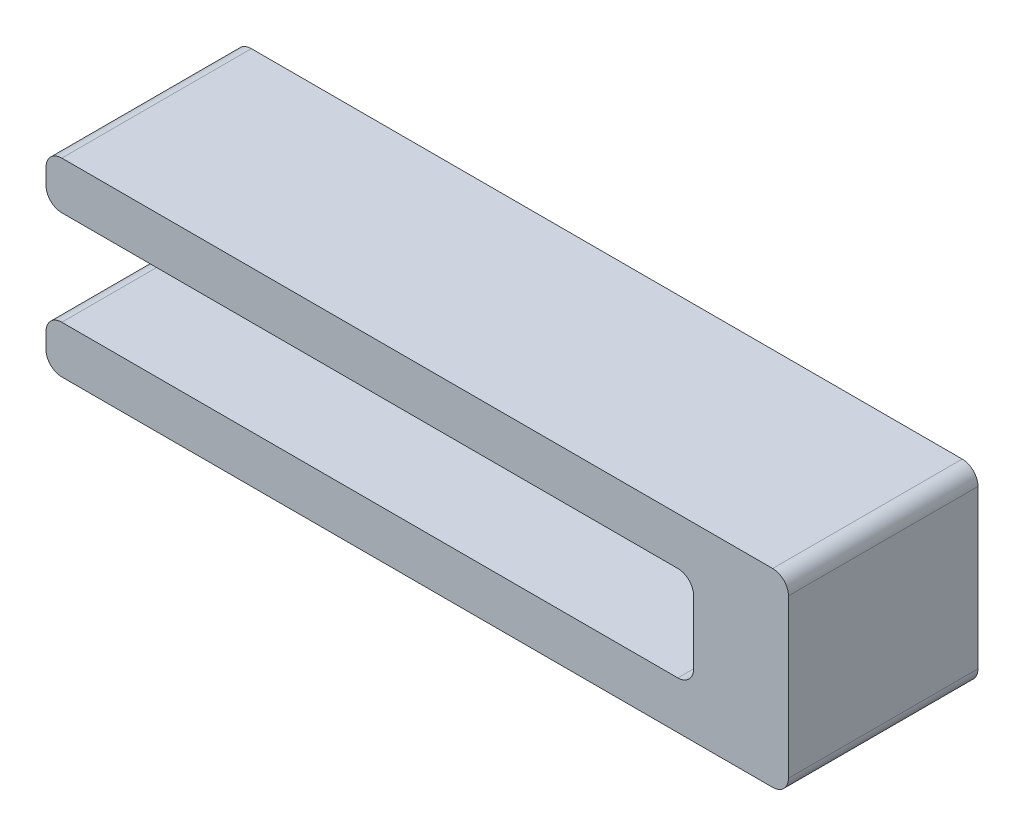
ISO-10303-21;
HEADER;
FILE_DESCRIPTION(('STEP AP214'),'2;1');
FILE_NAME('part.step','',(''),(''),'','','');
FILE_SCHEMA(('AUTOMOTIVE_DESIGN { 1 0 10303 214 1 1 1 1 }'));
ENDSEC;
DATA;
#1=APPLICATION_CONTEXT('core data for automotive mechanical design processes');
#2=APPLICATION_PROTOCOL_DEFINITION('international standard','automotive_design',2000,#1);
#3=PRODUCT_CONTEXT('',#1,'mechanical');
#4=PRODUCT('Part','Part','',(#3));
#5=PRODUCT_RELATED_PRODUCT_CATEGORY('part','',(#4));
#6=PRODUCT_DEFINITION_FORMATION('','',#4);
#7=PRODUCT_DEFINITION_CONTEXT('part definition',#1,'design');
#8=PRODUCT_DEFINITION('design','',#6,#7);
#9=PRODUCT_DEFINITION_SHAPE('','',#8);
#10=(LENGTH_UNIT() NAMED_UNIT(*) SI_UNIT(.MILLI.,.METRE.));
#11=(NAMED_UNIT(*) PLANE_ANGLE_UNIT() SI_UNIT($,.RADIAN.));
#12=(NAMED_UNIT(*) SI_UNIT($,.STERADIAN.) SOLID_ANGLE_UNIT());
#13=UNCERTAINTY_MEASURE_WITH_UNIT(LENGTH_MEASURE(1.E-05),#10,'distance_accuracy_value','');
#14=(GEOMETRIC_REPRESENTATION_CONTEXT(3) GLOBAL_UNCERTAINTY_ASSIGNED_CONTEXT((#13)) GLOBAL_UNIT_ASSIGNED_CONTEXT((#10,
#11,#12)) REPRESENTATION_CONTEXT('',''));
#15=CARTESIAN_POINT('',(0.,0.,0.));
#16=DIRECTION('',(0.,0.,1.));
#17=DIRECTION('',(1.,0.,0.));
#18=AXIS2_PLACEMENT_3D('',#15,#16,#17);
#19=CARTESIAN_POINT('',(0.,4.5,6.));
#20=DIRECTION('',(0.,1.,0.));
#21=DIRECTION('',(0.,0.,1.));
#22=AXIS2_PLACEMENT_3D('',#19,#20,#21);
#23=PLANE('',#22);
#24=DIRECTION('',(1.,0.,0.));
#25=VECTOR('',#24,1.);
#26=CARTESIAN_POINT('',(0.,4.5,0.));
#27=LINE('',#26,#25);
#28=CARTESIAN_POINT('',(0.5,4.5,0.));
#29=VERTEX_POINT('',#28);
#30=CARTESIAN_POINT('',(20.,4.5,0.));
#31=VERTEX_POINT('',#30);
#32=EDGE_CURVE('E190',#29,#31,#27,.T.);
#33=ORIENTED_EDGE('',*,*,#32,.T.);
#34=DIRECTION('',(0.,0.,-1.));
#35=VECTOR('',#34,1.);
#36=CARTESIAN_POINT('',(20.,4.5,6.));
#37=LINE('',#36,#35);
#38=CARTESIAN_POINT('',(20.,4.5,6.));
#39=VERTEX_POINT('',#38);
#40=EDGE_CURVE('E165',#31,#39,#37,.F.);
#41=ORIENTED_EDGE('',*,*,#40,.T.);
#42=DIRECTION('',(1.,0.,0.));
#43=VECTOR('',#42,1.);
#44=CARTESIAN_POINT('',(0.,4.5,6.));
#45=LINE('',#44,#43);
#46=CARTESIAN_POINT('',(0.5,4.5,6.));
#47=VERTEX_POINT('',#46);
#48=EDGE_CURVE('E322',#47,#39,#45,.T.);
#49=ORIENTED_EDGE('',*,*,#48,.F.);
#50=DIRECTION('',(0.,0.,-1.));
#51=VECTOR('',#50,1.);
#52=CARTESIAN_POINT('',(0.5,4.5,0.));
#53=LINE('',#52,#51);
#54=EDGE_CURVE('E182',#47,#29,#53,.T.);
#55=ORIENTED_EDGE('',*,*,#54,.T.);
#56=EDGE_LOOP('',(#33,#41,#49,#55));
#57=FACE_BOUND('',#56,.T.);
#58=ADVANCED_FACE('F45',(#57),#23,.F.);
#59=CARTESIAN_POINT('',(20.5,0.,6.));
#60=DIRECTION('',(1.,0.,0.));
#61=DIRECTION('',(0.,0.,-1.));
#62=AXIS2_PLACEMENT_3D('',#59,#60,#61);
#63=PLANE('',#62);
#64=DIRECTION('',(0.,-1.,0.));
#65=VECTOR('',#64,1.);
#66=CARTESIAN_POINT('',(20.5,0.,6.));
#67=LINE('',#66,#65);
#68=CARTESIAN_POINT('',(20.5,4.,6.));
#69=VERTEX_POINT('',#68);
#70=CARTESIAN_POINT('',(20.5,2.,6.));
#71=VERTEX_POINT('',#70);
#72=EDGE_CURVE('E180',#69,#71,#67,.T.);
#73=ORIENTED_EDGE('',*,*,#72,.F.);
#74=DIRECTION('',(0.,0.,-1.));
#75=VECTOR('',#74,1.);
#76=CARTESIAN_POINT('',(20.5,4.,0.));
#77=LINE('',#76,#75);
#78=CARTESIAN_POINT('',(20.5,4.,0.));
#79=VERTEX_POINT('',#78);
#80=EDGE_CURVE('E164',#69,#79,#77,.T.);
#81=ORIENTED_EDGE('',*,*,#80,.T.);
#82=DIRECTION('',(0.,-1.,0.));
#83=VECTOR('',#82,1.);
#84=CARTESIAN_POINT('',(20.5,0.,0.));
#85=LINE('',#84,#83);
#86=CARTESIAN_POINT('',(20.5,2.,0.));
#87=VERTEX_POINT('',#86);
#88=EDGE_CURVE('E177',#79,#87,#85,.T.);
#89=ORIENTED_EDGE('',*,*,#88,.T.);
#90=DIRECTION('',(0.,0.,-1.));
#91=VECTOR('',#90,1.);
#92=CARTESIAN_POINT('',(20.5,2.,6.));
#93=LINE('',#92,#91);
#94=EDGE_CURVE('E183',#87,#71,#93,.F.);
#95=ORIENTED_EDGE('',*,*,#94,.T.);
#96=EDGE_LOOP('',(#73,#81,#89,#95));
#97=FACE_BOUND('',#96,.T.);
#98=ADVANCED_FACE('F176',(#97),#63,.F.);
#99=CARTESIAN_POINT('',(0.,1.5,6.));
#100=DIRECTION('',(0.,1.,0.));
#101=DIRECTION('',(0.,0.,1.));
#102=AXIS2_PLACEMENT_3D('',#99,#100,#101);
#103=PLANE('',#102);
#104=DIRECTION('',(1.,0.,0.));
#105=VECTOR('',#104,1.);
#106=CARTESIAN_POINT('',(0.,1.5,6.));
#107=LINE('',#106,#105);
#108=CARTESIAN_POINT('',(0.5,1.5,6.));
#109=VERTEX_POINT('',#108);
#110=CARTESIAN_POINT('',(20.,1.5,6.));
#111=VERTEX_POINT('',#110);
#112=EDGE_CURVE('E317',#109,#111,#107,.T.);
#113=ORIENTED_EDGE('',*,*,#112,.T.);
#114=DIRECTION('',(0.,0.,-1.));
#115=VECTOR('',#114,1.);
#116=CARTESIAN_POINT('',(20.,1.5,6.));
#117=LINE('',#116,#115);
#118=CARTESIAN_POINT('',(20.,1.5,0.));
#119=VERTEX_POINT('',#118);
#120=EDGE_CURVE('E274',#111,#119,#117,.T.);
#121=ORIENTED_EDGE('',*,*,#120,.T.);
#122=DIRECTION('',(1.,0.,0.));
#123=VECTOR('',#122,1.);
#124=CARTESIAN_POINT('',(0.,1.5,0.));
#125=LINE('',#124,#123);
#126=CARTESIAN_POINT('',(0.5,1.5,0.));
#127=VERTEX_POINT('',#126);
#128=EDGE_CURVE('E189',#127,#119,#125,.T.);
#129=ORIENTED_EDGE('',*,*,#128,.F.);
#130=DIRECTION('',(0.,0.,-1.));
#131=VECTOR('',#130,1.);
#132=CARTESIAN_POINT('',(0.5,1.5,6.));
#133=LINE('',#132,#131);
#134=EDGE_CURVE('E271',#127,#109,#133,.F.);
#135=ORIENTED_EDGE('',*,*,#134,.T.);
#136=EDGE_LOOP('',(#113,#121,#129,#135));
#137=FACE_BOUND('',#136,.T.);
#138=ADVANCED_FACE('F343',(#137),#103,.T.);
#139=CARTESIAN_POINT('',(0.,0.,6.));
#140=DIRECTION('',(-1.,0.,0.));
#141=DIRECTION('',(0.,0.,1.));
#142=AXIS2_PLACEMENT_3D('',#139,#140,#141);
#143=PLANE('',#142);
#144=DIRECTION('',(0.,1.,0.));
#145=VECTOR('',#144,1.);
#146=CARTESIAN_POINT('',(0.,0.,0.));
#147=LINE('',#146,#145);
#148=CARTESIAN_POINT('',(0.,0.5,0.));
#149=VERTEX_POINT('',#148);
#150=CARTESIAN_POINT('',(0.,1.,0.));
#151=VERTEX_POINT('',#150);
#152=EDGE_CURVE('E194',#149,#151,#147,.T.);
#153=ORIENTED_EDGE('',*,*,#152,.F.);
#154=DIRECTION('',(0.,0.,-1.));
#155=VECTOR('',#154,1.);
#156=CARTESIAN_POINT('',(0.,0.5,6.));
#157=LINE('',#156,#155);
#158=CARTESIAN_POINT('',(0.,0.5,6.));
#159=VERTEX_POINT('',#158);
#160=EDGE_CURVE('E289',#149,#159,#157,.F.);
#161=ORIENTED_EDGE('',*,*,#160,.T.);
#162=DIRECTION('',(0.,1.,0.));
#163=VECTOR('',#162,1.);
#164=CARTESIAN_POINT('',(0.,0.,6.));
#165=LINE('',#164,#163);
#166=CARTESIAN_POINT('',(0.,1.,6.));
#167=VERTEX_POINT('',#166);
#168=EDGE_CURVE('E304',#159,#167,#165,.T.);
#169=ORIENTED_EDGE('',*,*,#168,.T.);
#170=DIRECTION('',(0.,0.,-1.));
#171=VECTOR('',#170,1.);
#172=CARTESIAN_POINT('',(0.,1.,6.));
#173=LINE('',#172,#171);
#174=EDGE_CURVE('E285',#167,#151,#173,.T.);
#175=ORIENTED_EDGE('',*,*,#174,.T.);
#176=EDGE_LOOP('',(#153,#161,#169,#175));
#177=FACE_BOUND('',#176,.T.);
#178=ADVANCED_FACE('F397',(#177),#143,.T.);
#179=CARTESIAN_POINT('',(0.,0.,6.));
#180=DIRECTION('',(0.,1.,0.));
#181=DIRECTION('',(0.,0.,1.));
#182=AXIS2_PLACEMENT_3D('',#179,#180,#181);
#183=PLANE('',#182);
#184=DIRECTION('',(1.,0.,0.));
#185=VECTOR('',#184,1.);
#186=CARTESIAN_POINT('',(0.,0.,0.));
#187=LINE('',#186,#185);
#188=CARTESIAN_POINT('',(0.5,0.,0.));
#189=VERTEX_POINT('',#188);
#190=CARTESIAN_POINT('',(23.,0.,0.));
#191=VERTEX_POINT('',#190);
#192=EDGE_CURVE('E202',#189,#191,#187,.T.);
#193=ORIENTED_EDGE('',*,*,#192,.T.);
#194=DIRECTION('',(0.,0.,-1.));
#195=VECTOR('',#194,1.);
#196=CARTESIAN_POINT('',(23.,0.,6.));
#197=LINE('',#196,#195);
#198=CARTESIAN_POINT('',(23.,0.,6.));
#199=VERTEX_POINT('',#198);
#200=EDGE_CURVE('E282',#191,#199,#197,.F.);
#201=ORIENTED_EDGE('',*,*,#200,.T.);
#202=DIRECTION('',(1.,0.,0.));
#203=VECTOR('',#202,1.);
#204=CARTESIAN_POINT('',(0.,0.,6.));
#205=LINE('',#204,#203);
#206=CARTESIAN_POINT('',(0.5,0.,6.));
#207=VERTEX_POINT('',#206);
#208=EDGE_CURVE('E310',#207,#199,#205,.T.);
#209=ORIENTED_EDGE('',*,*,#208,.F.);
#210=DIRECTION('',(0.,0.,-1.));
#211=VECTOR('',#210,1.);
#212=CARTESIAN_POINT('',(0.5,0.,0.));
#213=LINE('',#212,#211);
#214=EDGE_CURVE('E278',#207,#189,#213,.T.);
#215=ORIENTED_EDGE('',*,*,#214,.T.);
#216=EDGE_LOOP('',(#193,#201,#209,#215));
#217=FACE_BOUND('',#216,.T.);
#218=ADVANCED_FACE('F390',(#217),#183,.F.);
#219=CARTESIAN_POINT('',(23.5,0.,6.));
#220=DIRECTION('',(-1.,0.,0.));
#221=DIRECTION('',(0.,0.,1.));
#222=AXIS2_PLACEMENT_3D('',#219,#220,#221);
#223=PLANE('',#222);
#224=DIRECTION('',(0.,1.,0.));
#225=VECTOR('',#224,1.);
#226=CARTESIAN_POINT('',(23.5,0.,0.));
#227=LINE('',#226,#225);
#228=CARTESIAN_POINT('',(23.5,0.5,0.));
#229=VERTEX_POINT('',#228);
#230=CARTESIAN_POINT('',(23.5,5.5,0.));
#231=VERTEX_POINT('',#230);
#232=EDGE_CURVE('E207',#229,#231,#227,.T.);
#233=ORIENTED_EDGE('',*,*,#232,.T.);
#234=DIRECTION('',(0.,0.,-1.));
#235=VECTOR('',#234,1.);
#236=CARTESIAN_POINT('',(23.5,5.5,6.));
#237=LINE('',#236,#235);
#238=CARTESIAN_POINT('',(23.5,5.5,6.));
#239=VERTEX_POINT('',#238);
#240=EDGE_CURVE('E251',#231,#239,#237,.F.);
#241=ORIENTED_EDGE('',*,*,#240,.T.);
#242=DIRECTION('',(0.,1.,0.));
#243=VECTOR('',#242,1.);
#244=CARTESIAN_POINT('',(23.5,0.,6.));
#245=LINE('',#244,#243);
#246=CARTESIAN_POINT('',(23.5,0.5,6.));
#247=VERTEX_POINT('',#246);
#248=EDGE_CURVE('E307',#247,#239,#245,.T.);
#249=ORIENTED_EDGE('',*,*,#248,.F.);
#250=DIRECTION('',(0.,0.,-1.));
#251=VECTOR('',#250,1.);
#252=CARTESIAN_POINT('',(23.5,0.5,6.));
#253=LINE('',#252,#251);
#254=EDGE_CURVE('E247',#247,#229,#253,.T.);
#255=ORIENTED_EDGE('',*,*,#254,.T.);
#256=EDGE_LOOP('',(#233,#241,#249,#255));
#257=FACE_BOUND('',#256,.T.);
#258=ADVANCED_FACE('F384',(#257),#223,.F.);
#259=CARTESIAN_POINT('',(0.,6.,6.));
#260=DIRECTION('',(0.,1.,0.));
#261=DIRECTION('',(0.,0.,1.));
#262=AXIS2_PLACEMENT_3D('',#259,#260,#261);
#263=PLANE('',#262);
#264=DIRECTION('',(1.,0.,0.));
#265=VECTOR('',#264,1.);
#266=CARTESIAN_POINT('',(0.,6.,6.));
#267=LINE('',#266,#265);
#268=CARTESIAN_POINT('',(0.5,6.,6.));
#269=VERTEX_POINT('',#268);
#270=CARTESIAN_POINT('',(23.,6.,6.));
#271=VERTEX_POINT('',#270);
#272=EDGE_CURVE('E302',#269,#271,#267,.T.);
#273=ORIENTED_EDGE('',*,*,#272,.T.);
#274=DIRECTION('',(0.,0.,-1.));
#275=VECTOR('',#274,1.);
#276=CARTESIAN_POINT('',(23.,6.,0.));
#277=LINE('',#276,#275);
#278=CARTESIAN_POINT('',(23.,6.,0.));
#279=VERTEX_POINT('',#278);
#280=EDGE_CURVE('E225',#271,#279,#277,.T.);
#281=ORIENTED_EDGE('',*,*,#280,.T.);
#282=DIRECTION('',(1.,0.,0.));
#283=VECTOR('',#282,1.);
#284=CARTESIAN_POINT('',(0.,6.,0.));
#285=LINE('',#284,#283);
#286=CARTESIAN_POINT('',(0.5,6.,0.));
#287=VERTEX_POINT('',#286);
#288=EDGE_CURVE('E211',#287,#279,#285,.T.);
#289=ORIENTED_EDGE('',*,*,#288,.F.);
#290=DIRECTION('',(0.,0.,-1.));
#291=VECTOR('',#290,1.);
#292=CARTESIAN_POINT('',(0.5,6.,6.));
#293=LINE('',#292,#291);
#294=EDGE_CURVE('E222',#287,#269,#293,.F.);
#295=ORIENTED_EDGE('',*,*,#294,.T.);
#296=EDGE_LOOP('',(#273,#281,#289,#295));
#297=FACE_BOUND('',#296,.T.);
#298=ADVANCED_FACE('F377',(#297),#263,.T.);
#299=CARTESIAN_POINT('',(0.,5.,0.));
#300=VERTEX_POINT('',#299);
#301=CARTESIAN_POINT('',(0.,5.5,0.));
#302=VERTEX_POINT('',#301);
#303=EDGE_CURVE('E203',#300,#302,#147,.T.);
#304=ORIENTED_EDGE('',*,*,#303,.F.);
#305=DIRECTION('',(0.,0.,-1.));
#306=VECTOR('',#305,1.);
#307=CARTESIAN_POINT('',(0.,5.,6.));
#308=LINE('',#307,#306);
#309=CARTESIAN_POINT('',(0.,5.,6.));
#310=VERTEX_POINT('',#309);
#311=EDGE_CURVE('E68',#300,#310,#308,.F.);
#312=ORIENTED_EDGE('',*,*,#311,.T.);
#313=CARTESIAN_POINT('',(0.,5.5,6.));
#314=VERTEX_POINT('',#313);
#315=EDGE_CURVE('E215',#310,#314,#165,.T.);
#316=ORIENTED_EDGE('',*,*,#315,.T.);
#317=DIRECTION('',(0.,0.,-1.));
#318=VECTOR('',#317,1.);
#319=CARTESIAN_POINT('',(0.,5.5,6.));
#320=LINE('',#319,#318);
#321=EDGE_CURVE('E292',#314,#302,#320,.T.);
#322=ORIENTED_EDGE('',*,*,#321,.T.);
#323=EDGE_LOOP('',(#304,#312,#316,#322));
#324=FACE_BOUND('',#323,.T.);
#325=ADVANCED_FACE('F329',(#324),#143,.T.);
#326=CARTESIAN_POINT('',(0.,0.,6.));
#327=DIRECTION('',(0.,0.,1.));
#328=DIRECTION('',(1.,0.,0.));
#329=AXIS2_PLACEMENT_3D('',#326,#327,#328);
#330=PLANE('',#329);
#331=ORIENTED_EDGE('',*,*,#248,.T.);
#332=CARTESIAN_POINT('',(23.,5.5,6.));
#333=DIRECTION('',(0.,0.,1.));
#334=DIRECTION('',(1.,0.,0.));
#335=AXIS2_PLACEMENT_3D('',#332,#333,#334);
#336=CIRCLE('',#335,0.5);
#337=EDGE_CURVE('E268',#239,#271,#336,.T.);
#338=ORIENTED_EDGE('',*,*,#337,.T.);
#339=ORIENTED_EDGE('',*,*,#272,.F.);
#340=CARTESIAN_POINT('',(0.5,5.5,6.));
#341=DIRECTION('',(0.,0.,1.));
#342=DIRECTION('',(1.,0.,0.));
#343=AXIS2_PLACEMENT_3D('',#340,#341,#342);
#344=CIRCLE('',#343,0.5);
#345=EDGE_CURVE('E61',#269,#314,#344,.T.);
#346=ORIENTED_EDGE('',*,*,#345,.T.);
#347=ORIENTED_EDGE('',*,*,#315,.F.);
#348=CARTESIAN_POINT('',(0.5,5.,6.));
#349=DIRECTION('',(0.,0.,1.));
#350=DIRECTION('',(1.,0.,0.));
#351=AXIS2_PLACEMENT_3D('',#348,#349,#350);
#352=CIRCLE('',#351,0.5);
#353=EDGE_CURVE('E256',#310,#47,#352,.T.);
#354=ORIENTED_EDGE('',*,*,#353,.T.);
#355=ORIENTED_EDGE('',*,*,#48,.T.);
#356=CARTESIAN_POINT('',(20.,4.,6.));
#357=DIRECTION('',(0.,0.,1.));
#358=DIRECTION('',(1.,0.,0.));
#359=AXIS2_PLACEMENT_3D('',#356,#357,#358);
#360=CIRCLE('',#359,0.5);
#361=EDGE_CURVE('E171',#39,#69,#360,.F.);
#362=ORIENTED_EDGE('',*,*,#361,.T.);
#363=ORIENTED_EDGE('',*,*,#72,.T.);
#364=CARTESIAN_POINT('',(20.,2.,6.));
#365=DIRECTION('',(0.,0.,1.));
#366=DIRECTION('',(1.,0.,0.));
#367=AXIS2_PLACEMENT_3D('',#364,#365,#366);
#368=CIRCLE('',#367,0.5);
#369=EDGE_CURVE('E11',#71,#111,#368,.F.);
#370=ORIENTED_EDGE('',*,*,#369,.T.);
#371=ORIENTED_EDGE('',*,*,#112,.F.);
#372=CARTESIAN_POINT('',(0.5,1.,6.));
#373=DIRECTION('',(0.,0.,1.));
#374=DIRECTION('',(1.,0.,0.));
#375=AXIS2_PLACEMENT_3D('',#372,#373,#374);
#376=CIRCLE('',#375,0.5);
#377=EDGE_CURVE('E259',#109,#167,#376,.T.);
#378=ORIENTED_EDGE('',*,*,#377,.T.);
#379=ORIENTED_EDGE('',*,*,#168,.F.);
#380=CARTESIAN_POINT('',(0.5,0.5,6.));
#381=DIRECTION('',(0.,0.,1.));
#382=DIRECTION('',(1.,0.,0.));
#383=AXIS2_PLACEMENT_3D('',#380,#381,#382);
#384=CIRCLE('',#383,0.5);
#385=EDGE_CURVE('E262',#159,#207,#384,.T.);
#386=ORIENTED_EDGE('',*,*,#385,.T.);
#387=ORIENTED_EDGE('',*,*,#208,.T.);
#388=CARTESIAN_POINT('',(23.,0.5,6.));
#389=DIRECTION('',(0.,0.,1.));
#390=DIRECTION('',(1.,0.,0.));
#391=AXIS2_PLACEMENT_3D('',#388,#389,#390);
#392=CIRCLE('',#391,0.5);
#393=EDGE_CURVE('E265',#199,#247,#392,.T.);
#394=ORIENTED_EDGE('',*,*,#393,.T.);
#395=EDGE_LOOP('',(#331,#338,#339,#346,#347,#354,#355,#362,#363,#370,#371,#378,#379,#386,#387,#394));
#396=FACE_BOUND('',#395,.T.);
#397=ADVANCED_FACE('F336',(#396),#330,.T.);
#398=CARTESIAN_POINT('',(0.,0.,0.));
#399=DIRECTION('',(0.,0.,1.));
#400=DIRECTION('',(1.,0.,0.));
#401=AXIS2_PLACEMENT_3D('',#398,#399,#400);
#402=PLANE('',#401);
#403=ORIENTED_EDGE('',*,*,#288,.T.);
#404=CARTESIAN_POINT('',(23.,5.5,0.));
#405=DIRECTION('',(0.,0.,1.));
#406=DIRECTION('',(1.,0.,0.));
#407=AXIS2_PLACEMENT_3D('',#404,#405,#406);
#408=CIRCLE('',#407,0.5);
#409=EDGE_CURVE('E244',#279,#231,#408,.F.);
#410=ORIENTED_EDGE('',*,*,#409,.T.);
#411=ORIENTED_EDGE('',*,*,#232,.F.);
#412=CARTESIAN_POINT('',(23.,0.5,0.));
#413=DIRECTION('',(0.,0.,1.));
#414=DIRECTION('',(1.,0.,0.));
#415=AXIS2_PLACEMENT_3D('',#412,#413,#414);
#416=CIRCLE('',#415,0.5);
#417=EDGE_CURVE('E241',#229,#191,#416,.F.);
#418=ORIENTED_EDGE('',*,*,#417,.T.);
#419=ORIENTED_EDGE('',*,*,#192,.F.);
#420=CARTESIAN_POINT('',(0.5,0.5,0.));
#421=DIRECTION('',(0.,0.,1.));
#422=DIRECTION('',(1.,0.,0.));
#423=AXIS2_PLACEMENT_3D('',#420,#421,#422);
#424=CIRCLE('',#423,0.5);
#425=EDGE_CURVE('E238',#189,#149,#424,.F.);
#426=ORIENTED_EDGE('',*,*,#425,.T.);
#427=ORIENTED_EDGE('',*,*,#152,.T.);
#428=CARTESIAN_POINT('',(0.5,1.,0.));
#429=DIRECTION('',(0.,0.,1.));
#430=DIRECTION('',(1.,0.,0.));
#431=AXIS2_PLACEMENT_3D('',#428,#429,#430);
#432=CIRCLE('',#431,0.5);
#433=EDGE_CURVE('E235',#151,#127,#432,.F.);
#434=ORIENTED_EDGE('',*,*,#433,.T.);
#435=ORIENTED_EDGE('',*,*,#128,.T.);
#436=CARTESIAN_POINT('',(20.,2.,0.));
#437=DIRECTION('',(0.,0.,1.));
#438=DIRECTION('',(1.,0.,0.));
#439=AXIS2_PLACEMENT_3D('',#436,#437,#438);
#440=CIRCLE('',#439,0.5);
#441=EDGE_CURVE('E54',#119,#87,#440,.T.);
#442=ORIENTED_EDGE('',*,*,#441,.T.);
#443=ORIENTED_EDGE('',*,*,#88,.F.);
#444=CARTESIAN_POINT('',(20.,4.,0.));
#445=DIRECTION('',(0.,0.,1.));
#446=DIRECTION('',(1.,0.,0.));
#447=AXIS2_PLACEMENT_3D('',#444,#445,#446);
#448=CIRCLE('',#447,0.5);
#449=EDGE_CURVE('E160',#79,#31,#448,.T.);
#450=ORIENTED_EDGE('',*,*,#449,.T.);
#451=ORIENTED_EDGE('',*,*,#32,.F.);
#452=CARTESIAN_POINT('',(0.5,5.,0.));
#453=DIRECTION('',(0.,0.,1.));
#454=DIRECTION('',(1.,0.,0.));
#455=AXIS2_PLACEMENT_3D('',#452,#453,#454);
#456=CIRCLE('',#455,0.5);
#457=EDGE_CURVE('E232',#29,#300,#456,.F.);
#458=ORIENTED_EDGE('',*,*,#457,.T.);
#459=ORIENTED_EDGE('',*,*,#303,.T.);
#460=CARTESIAN_POINT('',(0.5,5.5,0.));
#461=DIRECTION('',(0.,0.,1.));
#462=DIRECTION('',(1.,0.,0.));
#463=AXIS2_PLACEMENT_3D('',#460,#461,#462);
#464=CIRCLE('',#463,0.5);
#465=EDGE_CURVE('E229',#302,#287,#464,.F.);
#466=ORIENTED_EDGE('',*,*,#465,.T.);
#467=EDGE_LOOP('',(#403,#410,#411,#418,#419,#426,#427,#434,#435,#442,#443,#450,#451,#458,#459,#466));
#468=FACE_BOUND('',#467,.T.);
#469=ADVANCED_FACE('F186',(#468),#402,.F.);
#470=CARTESIAN_POINT('',(20.,4.,6.));
#471=DIRECTION('',(0.,0.,1.));
#472=DIRECTION('',(1.,0.,0.));
#473=AXIS2_PLACEMENT_3D('',#470,#471,#472);
#474=CYLINDRICAL_SURFACE('',#473,0.5);
#475=ORIENTED_EDGE('',*,*,#361,.F.);
#476=ORIENTED_EDGE('',*,*,#40,.F.);
#477=ORIENTED_EDGE('',*,*,#449,.F.);
#478=ORIENTED_EDGE('',*,*,#80,.F.);
#479=EDGE_LOOP('',(#475,#476,#477,#478));
#480=FACE_BOUND('',#479,.T.);
#481=ADVANCED_FACE('F163',(#480),#474,.F.);
#482=CARTESIAN_POINT('',(23.,5.5,6.));
#483=DIRECTION('',(0.,0.,1.));
#484=DIRECTION('',(1.,0.,0.));
#485=AXIS2_PLACEMENT_3D('',#482,#483,#484);
#486=CYLINDRICAL_SURFACE('',#485,0.5);
#487=ORIENTED_EDGE('',*,*,#337,.F.);
#488=ORIENTED_EDGE('',*,*,#240,.F.);
#489=ORIENTED_EDGE('',*,*,#409,.F.);
#490=ORIENTED_EDGE('',*,*,#280,.F.);
#491=EDGE_LOOP('',(#487,#488,#489,#490));
#492=FACE_BOUND('',#491,.T.);
#493=ADVANCED_FACE('F349',(#492),#486,.T.);
#494=CARTESIAN_POINT('',(20.,2.,6.));
#495=DIRECTION('',(0.,0.,-1.));
#496=DIRECTION('',(-1.,0.,0.));
#497=AXIS2_PLACEMENT_3D('',#494,#495,#496);
#498=CYLINDRICAL_SURFACE('',#497,0.5);
#499=ORIENTED_EDGE('',*,*,#369,.F.);
#500=ORIENTED_EDGE('',*,*,#94,.F.);
#501=ORIENTED_EDGE('',*,*,#441,.F.);
#502=ORIENTED_EDGE('',*,*,#120,.F.);
#503=EDGE_LOOP('',(#499,#500,#501,#502));
#504=FACE_BOUND('',#503,.T.);
#505=ADVANCED_FACE('F352',(#504),#498,.F.);
#506=CARTESIAN_POINT('',(23.,0.5,6.));
#507=DIRECTION('',(0.,0.,-1.));
#508=DIRECTION('',(-1.,0.,0.));
#509=AXIS2_PLACEMENT_3D('',#506,#507,#508);
#510=CYLINDRICAL_SURFACE('',#509,0.5);
#511=ORIENTED_EDGE('',*,*,#393,.F.);
#512=ORIENTED_EDGE('',*,*,#200,.F.);
#513=ORIENTED_EDGE('',*,*,#417,.F.);
#514=ORIENTED_EDGE('',*,*,#254,.F.);
#515=EDGE_LOOP('',(#511,#512,#513,#514));
#516=FACE_BOUND('',#515,.T.);
#517=ADVANCED_FACE('F356',(#516),#510,.T.);
#518=CARTESIAN_POINT('',(0.5,0.5,6.));
#519=DIRECTION('',(0.,0.,1.));
#520=DIRECTION('',(1.,0.,0.));
#521=AXIS2_PLACEMENT_3D('',#518,#519,#520);
#522=CYLINDRICAL_SURFACE('',#521,0.5);
#523=ORIENTED_EDGE('',*,*,#385,.F.);
#524=ORIENTED_EDGE('',*,*,#160,.F.);
#525=ORIENTED_EDGE('',*,*,#425,.F.);
#526=ORIENTED_EDGE('',*,*,#214,.F.);
#527=EDGE_LOOP('',(#523,#524,#525,#526));
#528=FACE_BOUND('',#527,.T.);
#529=ADVANCED_FACE('F360',(#528),#522,.T.);
#530=CARTESIAN_POINT('',(0.5,1.,6.));
#531=DIRECTION('',(0.,0.,-1.));
#532=DIRECTION('',(-1.,0.,0.));
#533=AXIS2_PLACEMENT_3D('',#530,#531,#532);
#534=CYLINDRICAL_SURFACE('',#533,0.5);
#535=ORIENTED_EDGE('',*,*,#377,.F.);
#536=ORIENTED_EDGE('',*,*,#134,.F.);
#537=ORIENTED_EDGE('',*,*,#433,.F.);
#538=ORIENTED_EDGE('',*,*,#174,.F.);
#539=EDGE_LOOP('',(#535,#536,#537,#538));
#540=FACE_BOUND('',#539,.T.);
#541=ADVANCED_FACE('F364',(#540),#534,.T.);
#542=CARTESIAN_POINT('',(0.5,5.,6.));
#543=DIRECTION('',(0.,0.,1.));
#544=DIRECTION('',(1.,0.,0.));
#545=AXIS2_PLACEMENT_3D('',#542,#543,#544);
#546=CYLINDRICAL_SURFACE('',#545,0.5);
#547=ORIENTED_EDGE('',*,*,#353,.F.);
#548=ORIENTED_EDGE('',*,*,#311,.F.);
#549=ORIENTED_EDGE('',*,*,#457,.F.);
#550=ORIENTED_EDGE('',*,*,#54,.F.);
#551=EDGE_LOOP('',(#547,#548,#549,#550));
#552=FACE_BOUND('',#551,.T.);
#553=ADVANCED_FACE('F333',(#552),#546,.T.);
#554=CARTESIAN_POINT('',(0.5,5.5,6.));
#555=DIRECTION('',(0.,0.,-1.));
#556=DIRECTION('',(-1.,0.,0.));
#557=AXIS2_PLACEMENT_3D('',#554,#555,#556);
#558=CYLINDRICAL_SURFACE('',#557,0.5);
#559=ORIENTED_EDGE('',*,*,#345,.F.);
#560=ORIENTED_EDGE('',*,*,#294,.F.);
#561=ORIENTED_EDGE('',*,*,#465,.F.);
#562=ORIENTED_EDGE('',*,*,#321,.F.);
#563=EDGE_LOOP('',(#559,#560,#561,#562));
#564=FACE_BOUND('',#563,.T.);
#565=ADVANCED_FACE('F47',(#564),#558,.T.);
#566=CLOSED_SHELL('',(#58,#98,#138,#178,#218,#258,#298,#325,#397,#469,#481,#493,#505,#517,#529,
#541,#553,#565));
#567=MANIFOLD_SOLID_BREP('B2',#566);
#568=ADVANCED_BREP_SHAPE_REPRESENTATION('',(#18,#567),#14);
#569=SHAPE_DEFINITION_REPRESENTATION(#9,#568);
ENDSEC;
END-ISO-10303-21;
